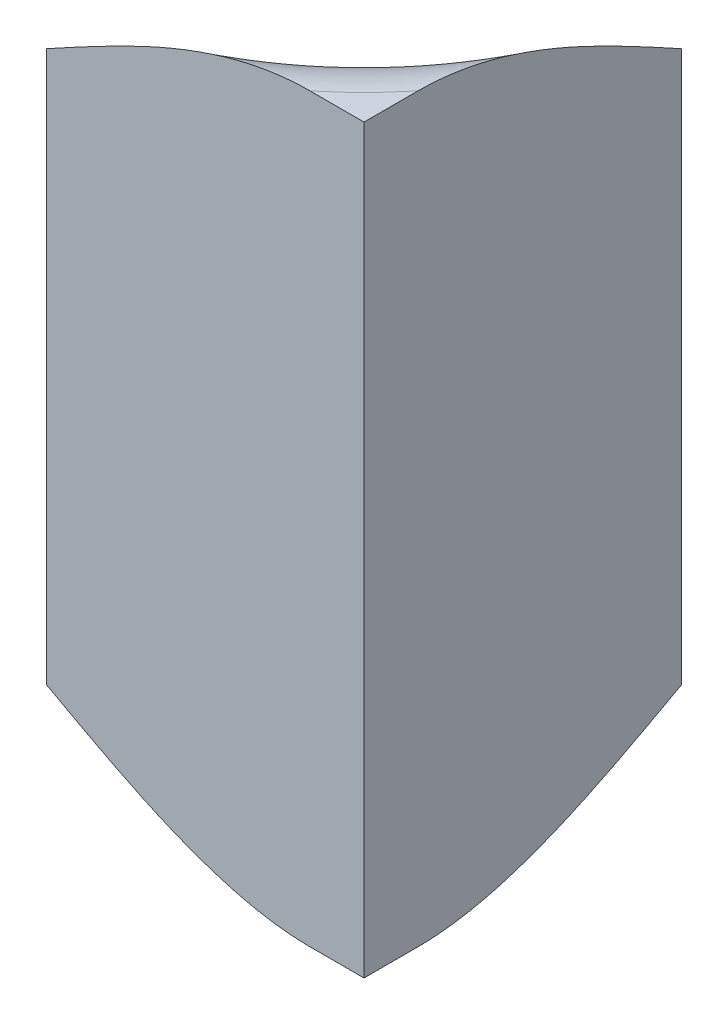
ISO-10303-21;
HEADER;
FILE_DESCRIPTION(('STEP AP214'),'2;1');
FILE_NAME('part.step','',(''),(''),'','','');
FILE_SCHEMA(('AUTOMOTIVE_DESIGN { 1 0 10303 214 1 1 1 1 }'));
ENDSEC;
DATA;
#1=APPLICATION_CONTEXT('core data for automotive mechanical design processes');
#2=APPLICATION_PROTOCOL_DEFINITION('international standard','automotive_design',2000,#1);
#3=PRODUCT_CONTEXT('',#1,'mechanical');
#4=PRODUCT('Part','Part','',(#3));
#5=PRODUCT_RELATED_PRODUCT_CATEGORY('part','',(#4));
#6=PRODUCT_DEFINITION_FORMATION('','',#4);
#7=PRODUCT_DEFINITION_CONTEXT('part definition',#1,'design');
#8=PRODUCT_DEFINITION('design','',#6,#7);
#9=PRODUCT_DEFINITION_SHAPE('','',#8);
#10=(LENGTH_UNIT() NAMED_UNIT(*) SI_UNIT(.MILLI.,.METRE.));
#11=(NAMED_UNIT(*) PLANE_ANGLE_UNIT() SI_UNIT($,.RADIAN.));
#12=(NAMED_UNIT(*) SI_UNIT($,.STERADIAN.) SOLID_ANGLE_UNIT());
#13=UNCERTAINTY_MEASURE_WITH_UNIT(LENGTH_MEASURE(1.E-05),#10,'distance_accuracy_value','');
#14=(GEOMETRIC_REPRESENTATION_CONTEXT(3) GLOBAL_UNCERTAINTY_ASSIGNED_CONTEXT((#13)) GLOBAL_UNIT_ASSIGNED_CONTEXT((#10,
#11,#12)) REPRESENTATION_CONTEXT('',''));
#15=CARTESIAN_POINT('',(0.,0.,0.));
#16=DIRECTION('',(0.,0.,1.));
#17=DIRECTION('',(1.,0.,0.));
#18=AXIS2_PLACEMENT_3D('',#15,#16,#17);
#19=CARTESIAN_POINT('',(2.1,1.06,-7.3));
#20=DIRECTION('',(0.,1.,0.));
#21=DIRECTION('',(0.,0.,1.));
#22=AXIS2_PLACEMENT_3D('',#19,#20,#21);
#23=TOROIDAL_SURFACE('',#22,0.389999999999999,0.0899999999999995);
#24=CARTESIAN_POINT('',(2.1,1.06,-7.3));
#25=DIRECTION('',(0.,1.,0.));
#26=DIRECTION('',(0.,0.,1.));
#27=AXIS2_PLACEMENT_3D('',#24,#25,#26);
#28=CIRCLE('',#27,0.299999999999999);
#29=CARTESIAN_POINT('',(2.10000000000001,1.06,-7.));
#30=VERTEX_POINT('',#29);
#31=CARTESIAN_POINT('',(2.4,1.06,-7.30000000000001));
#32=VERTEX_POINT('',#31);
#33=EDGE_CURVE('E73',#30,#32,#28,.T.);
#34=ORIENTED_EDGE('',*,*,#33,.F.);
#35=CARTESIAN_POINT('',(2.34919871588861,1.15,-7.));
#36=CARTESIAN_POINT('',(2.33460949679643,1.14996873881584,-7.));
#37=CARTESIAN_POINT('',(2.32012852606942,1.14856309488377,-7.));
#38=CARTESIAN_POINT('',(2.29170783023356,1.14368423695863,-7.));
#39=CARTESIAN_POINT('',(2.27776341142426,1.14023956259986,-7.));
#40=CARTESIAN_POINT('',(2.23579746304957,1.12752219042687,-7.));
#41=CARTESIAN_POINT('',(2.20852197960268,1.11594220810296,-7.));
#42=CARTESIAN_POINT('',(2.15516434547716,1.0901561510901,-7.));
#43=CARTESIAN_POINT('',(2.12909196209091,1.07593214013202,-7.));
#44=CARTESIAN_POINT('',(2.10202548981968,1.06110939531163,-7.));
#45=CARTESIAN_POINT('',(2.10101275081159,1.06055469450969,-7.));
#46=CARTESIAN_POINT('',(2.1,1.06,-7.));
#47=B_SPLINE_CURVE_WITH_KNOTS('',3,(#35,#36,#37,#38,#39,#40,#41,#42,#43,#44,#45,#46),
.UNSPECIFIED.,.F.,.F.,(4,2,2,2,2,4),(0.,0.0435527295939521,0.0865098187320554,0.17500096336578,
0.264115894109955,0.267579995726728),.UNSPECIFIED.);
#48=CARTESIAN_POINT('',(2.34919871588808,1.15,-7.));
#49=VERTEX_POINT('',#48);
#50=EDGE_CURVE('E68',#49,#30,#47,.T.);
#51=ORIENTED_EDGE('',*,*,#50,.F.);
#52=CARTESIAN_POINT('',(2.1,1.15,-7.3));
#53=DIRECTION('',(0.,1.,0.));
#54=DIRECTION('',(0.,0.,1.));
#55=AXIS2_PLACEMENT_3D('',#52,#53,#54);
#56=CIRCLE('',#55,0.39);
#57=CARTESIAN_POINT('',(2.4,1.15,-7.05080128411123));
#58=VERTEX_POINT('',#57);
#59=EDGE_CURVE('E21',#58,#49,#56,.F.);
#60=ORIENTED_EDGE('',*,*,#59,.F.);
#61=CARTESIAN_POINT('',(2.4,1.15,-7.05080128411138));
#62=CARTESIAN_POINT('',(2.4,1.14996873881585,-7.0653905032036));
#63=CARTESIAN_POINT('',(2.4,1.14856309488378,-7.07987147393061));
#64=CARTESIAN_POINT('',(2.4,1.14368423695862,-7.10829216976647));
#65=CARTESIAN_POINT('',(2.4,1.14023956259984,-7.12223658857575));
#66=CARTESIAN_POINT('',(2.4,1.12752219042689,-7.16420253695043));
#67=CARTESIAN_POINT('',(2.4,1.11594220810309,-7.19147802039737));
#68=CARTESIAN_POINT('',(2.4,1.09015615108999,-7.24483565452275));
#69=CARTESIAN_POINT('',(2.4,1.07593214013154,-7.27090803790882));
#70=CARTESIAN_POINT('',(2.4,1.06110939531159,-7.2979745101803));
#71=CARTESIAN_POINT('',(2.4,1.06055469450967,-7.2989872491884));
#72=CARTESIAN_POINT('',(2.4,1.06,-7.3));
#73=B_SPLINE_CURVE_WITH_KNOTS('',3,(#61,#62,#63,#64,#65,#66,#67,#68,#69,#70,#71,#72),
.UNSPECIFIED.,.F.,.F.,(4,2,2,2,2,4),(0.,0.0435527295940025,0.0865098187320563,0.175000963365752,
0.264115894109953,0.267579995726728),.UNSPECIFIED.);
#74=EDGE_CURVE('E65',#32,#58,#73,.F.);
#75=ORIENTED_EDGE('',*,*,#74,.F.);
#76=EDGE_LOOP('',(#34,#51,#60,#75));
#77=FACE_BOUND('',#76,.T.);
#78=ADVANCED_FACE('F17',(#77),#23,.T.);
#79=CARTESIAN_POINT('',(2.1,0.54,-7.3));
#80=DIRECTION('',(0.,1.,0.));
#81=DIRECTION('',(0.,0.,1.));
#82=AXIS2_PLACEMENT_3D('',#79,#80,#81);
#83=CYLINDRICAL_SURFACE('',#82,0.299999999999999);
#84=DIRECTION('',(0.,-1.,0.));
#85=VECTOR('',#84,1.);
#86=CARTESIAN_POINT('',(2.1,0.800000000000238,-7.));
#87=LINE('',#86,#85);
#88=CARTESIAN_POINT('',(2.1,0.54,-7.));
#89=VERTEX_POINT('',#88);
#90=EDGE_CURVE('E84',#30,#89,#87,.T.);
#91=ORIENTED_EDGE('',*,*,#90,.F.);
#92=ORIENTED_EDGE('',*,*,#33,.T.);
#93=DIRECTION('',(0.,1.,0.));
#94=VECTOR('',#93,1.);
#95=CARTESIAN_POINT('',(2.4,0.799999999999761,-7.3));
#96=LINE('',#95,#94);
#97=CARTESIAN_POINT('',(2.4,0.54,-7.3));
#98=VERTEX_POINT('',#97);
#99=EDGE_CURVE('E82',#98,#32,#96,.T.);
#100=ORIENTED_EDGE('',*,*,#99,.F.);
#101=CARTESIAN_POINT('',(2.1,0.54,-7.3));
#102=DIRECTION('',(0.,1.,0.));
#103=DIRECTION('',(0.,0.,1.));
#104=AXIS2_PLACEMENT_3D('',#101,#102,#103);
#105=CIRCLE('',#104,0.299999999999999);
#106=EDGE_CURVE('E72',#89,#98,#105,.T.);
#107=ORIENTED_EDGE('',*,*,#106,.F.);
#108=EDGE_LOOP('',(#91,#92,#100,#107));
#109=FACE_BOUND('',#108,.T.);
#110=ADVANCED_FACE('F144',(#109),#83,.F.);
#111=CARTESIAN_POINT('',(2.348198715889,1.15,-7.051801284111));
#112=DIRECTION('',(0.,1.,0.));
#113=DIRECTION('',(0.,0.,1.));
#114=AXIS2_PLACEMENT_3D('',#111,#112,#113);
#115=PLANE('',#114);
#116=DIRECTION('',(-1.,0.,0.));
#117=VECTOR('',#116,1.);
#118=CARTESIAN_POINT('',(2.25,1.15,-7.));
#119=LINE('',#118,#117);
#120=CARTESIAN_POINT('',(2.4,1.15,-7.));
#121=VERTEX_POINT('',#120);
#122=EDGE_CURVE('E76',#121,#49,#119,.T.);
#123=ORIENTED_EDGE('',*,*,#122,.F.);
#124=DIRECTION('',(0.,0.,1.));
#125=VECTOR('',#124,1.);
#126=CARTESIAN_POINT('',(2.4,1.15,-7.15));
#127=LINE('',#126,#125);
#128=EDGE_CURVE('E74',#58,#121,#127,.T.);
#129=ORIENTED_EDGE('',*,*,#128,.F.);
#130=ORIENTED_EDGE('',*,*,#59,.T.);
#131=EDGE_LOOP('',(#123,#129,#130));
#132=FACE_BOUND('',#131,.T.);
#133=ADVANCED_FACE('F75',(#132),#115,.T.);
#134=CARTESIAN_POINT('',(2.1,0.54,-7.3));
#135=DIRECTION('',(0.,-1.,0.));
#136=DIRECTION('',(0.,0.,-1.));
#137=AXIS2_PLACEMENT_3D('',#134,#135,#136);
#138=TOROIDAL_SURFACE('',#137,0.39,0.0900000000000006);
#139=CARTESIAN_POINT('',(2.1,0.449999999999999,-7.3));
#140=DIRECTION('',(0.,-1.,0.));
#141=DIRECTION('',(0.,0.,-1.));
#142=AXIS2_PLACEMENT_3D('',#139,#140,#141);
#143=CIRCLE('',#142,0.389999999999999);
#144=CARTESIAN_POINT('',(2.34919871588827,0.449999999999999,-7.0000000000006));
#145=VERTEX_POINT('',#144);
#146=CARTESIAN_POINT('',(2.4,0.449999999999999,-7.05080128411192));
#147=VERTEX_POINT('',#146);
#148=EDGE_CURVE('E119',#145,#147,#143,.F.);
#149=ORIENTED_EDGE('',*,*,#148,.F.);
#150=CARTESIAN_POINT('',(2.34919871588861,0.449999999999999,-7.));
#151=CARTESIAN_POINT('',(2.33460949679643,0.450031261184167,-7.));
#152=CARTESIAN_POINT('',(2.32012852606943,0.451436905116226,-7.));
#153=CARTESIAN_POINT('',(2.29170783023357,0.456315763041362,-7.));
#154=CARTESIAN_POINT('',(2.27776341142426,0.459760437400134,-7.));
#155=CARTESIAN_POINT('',(2.23579746304957,0.472477809573137,-7.));
#156=CARTESIAN_POINT('',(2.20852197960269,0.484057791897068,-7.));
#157=CARTESIAN_POINT('',(2.15516434547714,0.509843848909869,-7.));
#158=CARTESIAN_POINT('',(2.12909196209085,0.524067859867879,-7.));
#159=CARTESIAN_POINT('',(2.10202548981968,0.538890604688367,-7.));
#160=CARTESIAN_POINT('',(2.10101275081158,0.539445305490306,-7.));
#161=CARTESIAN_POINT('',(2.1,0.54,-7.));
#162=B_SPLINE_CURVE_WITH_KNOTS('',3,(#150,#151,#152,#153,#154,#155,#156,#157,#158,#159,#160,
#161),.UNSPECIFIED.,.F.,.F.,(4,2,2,2,2,4),(0.,0.0435527295939416,0.0865098187320572,
0.175000963365788,0.264115894109956,0.267579995726729),.UNSPECIFIED.);
#163=EDGE_CURVE('E113',#89,#145,#162,.F.);
#164=ORIENTED_EDGE('',*,*,#163,.F.);
#165=ORIENTED_EDGE('',*,*,#106,.T.);
#166=CARTESIAN_POINT('',(2.4,0.449999999999999,-7.05080128411138));
#167=CARTESIAN_POINT('',(2.4,0.450031261184154,-7.06539050320359));
#168=CARTESIAN_POINT('',(2.4,0.451436905116223,-7.07987147393061));
#169=CARTESIAN_POINT('',(2.4,0.456315763041376,-7.10829216976646));
#170=CARTESIAN_POINT('',(2.4,0.459760437400152,-7.12223658857575));
#171=CARTESIAN_POINT('',(2.4,0.47247780957311,-7.16420253695043));
#172=CARTESIAN_POINT('',(2.4,0.484057791896935,-7.19147802039736));
#173=CARTESIAN_POINT('',(2.4,0.50984384890999,-7.24483565452277));
#174=CARTESIAN_POINT('',(2.4,0.524067859868365,-7.27090803790887));
#175=CARTESIAN_POINT('',(2.4,0.538890604688404,-7.29797451018031));
#176=CARTESIAN_POINT('',(2.4,0.539445305490326,-7.29898724918841));
#177=CARTESIAN_POINT('',(2.4,0.54,-7.3));
#178=B_SPLINE_CURVE_WITH_KNOTS('',3,(#166,#167,#168,#169,#170,#171,#172,#173,#174,#175,#176,
#177),.UNSPECIFIED.,.F.,.F.,(4,2,2,2,2,4),(0.,0.043552729593992,0.0865098187320573,
0.175000963365758,0.264115894109955,0.267579995726728),.UNSPECIFIED.);
#179=EDGE_CURVE('E77',#147,#98,#178,.T.);
#180=ORIENTED_EDGE('',*,*,#179,.F.);
#181=EDGE_LOOP('',(#149,#164,#165,#180));
#182=FACE_BOUND('',#181,.T.);
#183=ADVANCED_FACE('F105',(#182),#138,.T.);
#184=CARTESIAN_POINT('',(2.4,1.15100000000047,-6.999));
#185=DIRECTION('',(1.,0.,0.));
#186=DIRECTION('',(0.,-1.,0.));
#187=AXIS2_PLACEMENT_3D('',#184,#185,#186);
#188=PLANE('',#187);
#189=ORIENTED_EDGE('',*,*,#99,.T.);
#190=ORIENTED_EDGE('',*,*,#74,.T.);
#191=ORIENTED_EDGE('',*,*,#128,.T.);
#192=DIRECTION('',(0.,1.,0.));
#193=VECTOR('',#192,1.);
#194=CARTESIAN_POINT('',(2.4,0.800000000000238,-7.));
#195=LINE('',#194,#193);
#196=CARTESIAN_POINT('',(2.4,0.45,-7.));
#197=VERTEX_POINT('',#196);
#198=EDGE_CURVE('E36',#197,#121,#195,.T.);
#199=ORIENTED_EDGE('',*,*,#198,.F.);
#200=DIRECTION('',(0.,0.,1.));
#201=VECTOR('',#200,1.);
#202=CARTESIAN_POINT('',(2.4,0.45,-7.0254006420555));
#203=LINE('',#202,#201);
#204=EDGE_CURVE('E27',#147,#197,#203,.T.);
#205=ORIENTED_EDGE('',*,*,#204,.F.);
#206=ORIENTED_EDGE('',*,*,#179,.T.);
#207=EDGE_LOOP('',(#189,#190,#191,#199,#205,#206));
#208=FACE_BOUND('',#207,.T.);
#209=ADVANCED_FACE('F79',(#208),#188,.T.);
#210=CARTESIAN_POINT('',(2.099,1.15100000000095,-7.));
#211=DIRECTION('',(0.,0.,1.));
#212=DIRECTION('',(0.,-1.,0.));
#213=AXIS2_PLACEMENT_3D('',#210,#211,#212);
#214=PLANE('',#213);
#215=ORIENTED_EDGE('',*,*,#198,.T.);
#216=ORIENTED_EDGE('',*,*,#122,.T.);
#217=ORIENTED_EDGE('',*,*,#50,.T.);
#218=ORIENTED_EDGE('',*,*,#90,.T.);
#219=ORIENTED_EDGE('',*,*,#163,.T.);
#220=DIRECTION('',(-1.,0.,0.));
#221=VECTOR('',#220,1.);
#222=CARTESIAN_POINT('',(2.3745993579445,0.45,-7.));
#223=LINE('',#222,#221);
#224=EDGE_CURVE('E11',#197,#145,#223,.T.);
#225=ORIENTED_EDGE('',*,*,#224,.F.);
#226=EDGE_LOOP('',(#215,#216,#217,#218,#219,#225));
#227=FACE_BOUND('',#226,.T.);
#228=ADVANCED_FACE('F104',(#227),#214,.T.);
#229=CARTESIAN_POINT('',(2.348198715889,0.45,-6.999));
#230=DIRECTION('',(0.,-1.,0.));
#231=DIRECTION('',(0.,0.,-1.));
#232=AXIS2_PLACEMENT_3D('',#229,#230,#231);
#233=PLANE('',#232);
#234=ORIENTED_EDGE('',*,*,#204,.T.);
#235=ORIENTED_EDGE('',*,*,#224,.T.);
#236=ORIENTED_EDGE('',*,*,#148,.T.);
#237=EDGE_LOOP('',(#234,#235,#236));
#238=FACE_BOUND('',#237,.T.);
#239=ADVANCED_FACE('F19',(#238),#233,.T.);
#240=CLOSED_SHELL('',(#78,#110,#133,#183,#209,#228,#239));
#241=MANIFOLD_SOLID_BREP('B1',#240);
#242=ADVANCED_BREP_SHAPE_REPRESENTATION('',(#18,#241),#14);
#243=SHAPE_DEFINITION_REPRESENTATION(#9,#242);
ENDSEC;
END-ISO-10303-21;
